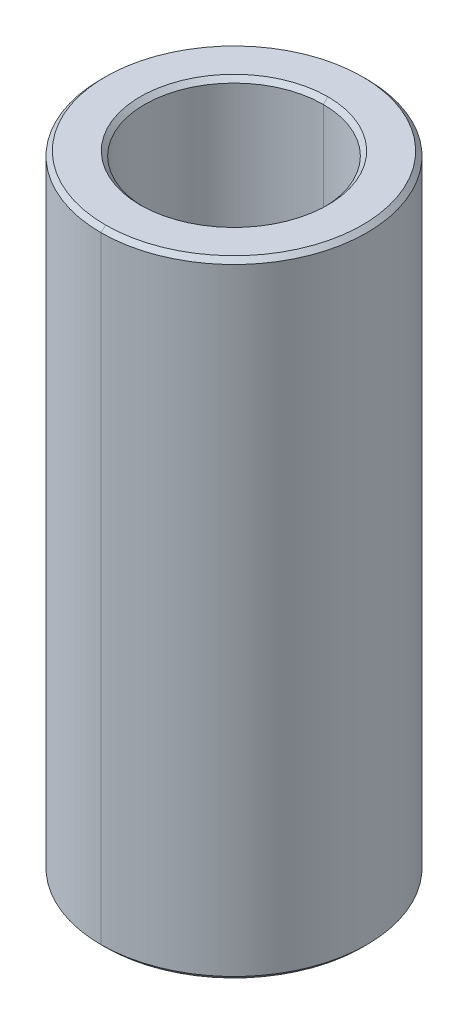
ISO-10303-21;
HEADER;
FILE_DESCRIPTION(('STEP AP214'),'2;1');
FILE_NAME('part.step','',(''),(''),'','','');
FILE_SCHEMA(('AUTOMOTIVE_DESIGN { 1 0 10303 214 1 1 1 1 }'));
ENDSEC;
DATA;
#1=APPLICATION_CONTEXT('core data for automotive mechanical design processes');
#2=APPLICATION_PROTOCOL_DEFINITION('international standard','automotive_design',2000,#1);
#3=PRODUCT_CONTEXT('',#1,'mechanical');
#4=PRODUCT('Part','Part','',(#3));
#5=PRODUCT_RELATED_PRODUCT_CATEGORY('part','',(#4));
#6=PRODUCT_DEFINITION_FORMATION('','',#4);
#7=PRODUCT_DEFINITION_CONTEXT('part definition',#1,'design');
#8=PRODUCT_DEFINITION('design','',#6,#7);
#9=PRODUCT_DEFINITION_SHAPE('','',#8);
#10=(LENGTH_UNIT() NAMED_UNIT(*) SI_UNIT(.MILLI.,.METRE.));
#11=(NAMED_UNIT(*) PLANE_ANGLE_UNIT() SI_UNIT($,.RADIAN.));
#12=(NAMED_UNIT(*) SI_UNIT($,.STERADIAN.) SOLID_ANGLE_UNIT());
#13=UNCERTAINTY_MEASURE_WITH_UNIT(LENGTH_MEASURE(1.E-05),#10,'distance_accuracy_value','');
#14=(GEOMETRIC_REPRESENTATION_CONTEXT(3) GLOBAL_UNCERTAINTY_ASSIGNED_CONTEXT((#13)) GLOBAL_UNIT_ASSIGNED_CONTEXT((#10,
#11,#12)) REPRESENTATION_CONTEXT('',''));
#15=CARTESIAN_POINT('',(0.,0.,0.));
#16=DIRECTION('',(0.,0.,1.));
#17=DIRECTION('',(1.,0.,0.));
#18=AXIS2_PLACEMENT_3D('',#15,#16,#17);
#19=CARTESIAN_POINT('',(0.,6.9,0.));
#20=DIRECTION('',(0.,1.,0.));
#21=DIRECTION('',(0.,0.,1.));
#22=AXIS2_PLACEMENT_3D('',#19,#20,#21);
#23=CONICAL_SURFACE('',#22,2.,0.785398163397448);
#24=DIRECTION('',(0.,0.707106781186548,-0.707106781186548));
#25=VECTOR('',#24,1.);
#26=CARTESIAN_POINT('',(0.,6.9,-2.));
#27=LINE('',#26,#25);
#28=CARTESIAN_POINT('',(0.,6.9,-2.));
#29=VERTEX_POINT('',#28);
#30=CARTESIAN_POINT('',(0.,7.,-2.1));
#31=VERTEX_POINT('',#30);
#32=EDGE_CURVE('E119',#29,#31,#27,.T.);
#33=ORIENTED_EDGE('',*,*,#32,.F.);
#34=CARTESIAN_POINT('',(0.,6.9,0.));
#35=DIRECTION('',(0.,1.,0.));
#36=DIRECTION('',(0.,0.,1.));
#37=AXIS2_PLACEMENT_3D('',#34,#35,#36);
#38=CIRCLE('',#37,2.);
#39=CARTESIAN_POINT('',(0.,6.9,2.));
#40=VERTEX_POINT('',#39);
#41=EDGE_CURVE('E25',#40,#29,#38,.T.);
#42=ORIENTED_EDGE('',*,*,#41,.F.);
#43=DIRECTION('',(0.,0.707106781186548,0.707106781186548));
#44=VECTOR('',#43,1.);
#45=CARTESIAN_POINT('',(0.,6.9,2.));
#46=LINE('',#45,#44);
#47=CARTESIAN_POINT('',(0.,7.,2.1));
#48=VERTEX_POINT('',#47);
#49=EDGE_CURVE('E116',#40,#48,#46,.T.);
#50=ORIENTED_EDGE('',*,*,#49,.T.);
#51=CARTESIAN_POINT('',(0.,7.,0.));
#52=DIRECTION('',(0.,-1.,0.));
#53=DIRECTION('',(0.,0.,1.));
#54=AXIS2_PLACEMENT_3D('',#51,#52,#53);
#55=CIRCLE('',#54,2.1);
#56=EDGE_CURVE('E155',#31,#48,#55,.T.);
#57=ORIENTED_EDGE('',*,*,#56,.F.);
#58=EDGE_LOOP('',(#33,#42,#50,#57));
#59=FACE_BOUND('',#58,.T.);
#60=ADVANCED_FACE('F14',(#59),#23,.F.);
#61=CARTESIAN_POINT('',(0.,-7.,0.));
#62=DIRECTION('',(0.,-1.,0.));
#63=DIRECTION('',(0.,0.,-1.));
#64=AXIS2_PLACEMENT_3D('',#61,#62,#63);
#65=CONICAL_SURFACE('',#64,2.1,0.785398163397457);
#66=DIRECTION('',(0.,-0.707106781186542,0.707106781186554));
#67=VECTOR('',#66,1.);
#68=CARTESIAN_POINT('',(0.,-7.,2.1));
#69=LINE('',#68,#67);
#70=CARTESIAN_POINT('',(0.,-6.9,2.));
#71=VERTEX_POINT('',#70);
#72=CARTESIAN_POINT('',(0.,-7.,2.1));
#73=VERTEX_POINT('',#72);
#74=EDGE_CURVE('E192',#71,#73,#69,.T.);
#75=ORIENTED_EDGE('',*,*,#74,.F.);
#76=CARTESIAN_POINT('',(0.,-6.9,0.));
#77=DIRECTION('',(0.,-1.,0.));
#78=DIRECTION('',(0.,0.,1.));
#79=AXIS2_PLACEMENT_3D('',#76,#77,#78);
#80=CIRCLE('',#79,2.);
#81=CARTESIAN_POINT('',(0.,-6.9,-2.));
#82=VERTEX_POINT('',#81);
#83=EDGE_CURVE('E9',#82,#71,#80,.T.);
#84=ORIENTED_EDGE('',*,*,#83,.F.);
#85=DIRECTION('',(0.,-0.707106781186542,-0.707106781186554));
#86=VECTOR('',#85,1.);
#87=CARTESIAN_POINT('',(0.,-7.,-2.1));
#88=LINE('',#87,#86);
#89=CARTESIAN_POINT('',(0.,-7.,-2.1));
#90=VERTEX_POINT('',#89);
#91=EDGE_CURVE('E200',#82,#90,#88,.T.);
#92=ORIENTED_EDGE('',*,*,#91,.T.);
#93=CARTESIAN_POINT('',(0.,-7.,0.));
#94=DIRECTION('',(0.,1.,0.));
#95=DIRECTION('',(0.,0.,1.));
#96=AXIS2_PLACEMENT_3D('',#93,#94,#95);
#97=CIRCLE('',#96,2.1);
#98=EDGE_CURVE('E68',#73,#90,#97,.T.);
#99=ORIENTED_EDGE('',*,*,#98,.F.);
#100=EDGE_LOOP('',(#75,#84,#92,#99));
#101=FACE_BOUND('',#100,.T.);
#102=ADVANCED_FACE('F16',(#101),#65,.F.);
#103=CARTESIAN_POINT('',(0.,7.,0.));
#104=DIRECTION('',(0.,-1.,0.));
#105=DIRECTION('',(0.,0.,-1.));
#106=AXIS2_PLACEMENT_3D('',#103,#104,#105);
#107=CONICAL_SURFACE('',#106,2.875,0.785398163397448);
#108=DIRECTION('',(0.,-0.707106781186548,0.707106781186548));
#109=VECTOR('',#108,1.);
#110=CARTESIAN_POINT('',(0.,7.,2.875));
#111=LINE('',#110,#109);
#112=CARTESIAN_POINT('',(0.,7.,2.875));
#113=VERTEX_POINT('',#112);
#114=CARTESIAN_POINT('',(0.,6.9,2.975));
#115=VERTEX_POINT('',#114);
#116=EDGE_CURVE('E185',#113,#115,#111,.T.);
#117=ORIENTED_EDGE('',*,*,#116,.F.);
#118=CARTESIAN_POINT('',(0.,7.,0.));
#119=DIRECTION('',(0.,1.,0.));
#120=DIRECTION('',(0.,0.,1.));
#121=AXIS2_PLACEMENT_3D('',#118,#119,#120);
#122=CIRCLE('',#121,2.875);
#123=CARTESIAN_POINT('',(0.,7.,-2.875));
#124=VERTEX_POINT('',#123);
#125=EDGE_CURVE('E56',#124,#113,#122,.T.);
#126=ORIENTED_EDGE('',*,*,#125,.F.);
#127=DIRECTION('',(0.,-0.707106781186548,-0.707106781186548));
#128=VECTOR('',#127,1.);
#129=CARTESIAN_POINT('',(0.,7.,-2.875));
#130=LINE('',#129,#128);
#131=CARTESIAN_POINT('',(0.,6.9,-2.975));
#132=VERTEX_POINT('',#131);
#133=EDGE_CURVE('E163',#124,#132,#130,.T.);
#134=ORIENTED_EDGE('',*,*,#133,.T.);
#135=CARTESIAN_POINT('',(0.,6.9,0.));
#136=DIRECTION('',(0.,-1.,0.));
#137=DIRECTION('',(0.,0.,1.));
#138=AXIS2_PLACEMENT_3D('',#135,#136,#137);
#139=CIRCLE('',#138,2.975);
#140=EDGE_CURVE('E225',#115,#132,#139,.T.);
#141=ORIENTED_EDGE('',*,*,#140,.F.);
#142=EDGE_LOOP('',(#117,#126,#134,#141));
#143=FACE_BOUND('',#142,.T.);
#144=ADVANCED_FACE('F239',(#143),#107,.T.);
#145=CARTESIAN_POINT('',(0.,-6.9,0.));
#146=DIRECTION('',(0.,1.,0.));
#147=DIRECTION('',(0.,0.,1.));
#148=AXIS2_PLACEMENT_3D('',#145,#146,#147);
#149=CONICAL_SURFACE('',#148,2.975,0.785398163397448);
#150=DIRECTION('',(0.,0.707106781186548,-0.707106781186548));
#151=VECTOR('',#150,1.);
#152=CARTESIAN_POINT('',(0.,-6.9,-2.975));
#153=LINE('',#152,#151);
#154=CARTESIAN_POINT('',(0.,-7.,-2.875));
#155=VERTEX_POINT('',#154);
#156=CARTESIAN_POINT('',(0.,-6.9,-2.975));
#157=VERTEX_POINT('',#156);
#158=EDGE_CURVE('E159',#155,#157,#153,.T.);
#159=ORIENTED_EDGE('',*,*,#158,.F.);
#160=CARTESIAN_POINT('',(0.,-7.,0.));
#161=DIRECTION('',(0.,-1.,0.));
#162=DIRECTION('',(0.,0.,1.));
#163=AXIS2_PLACEMENT_3D('',#160,#161,#162);
#164=CIRCLE('',#163,2.875);
#165=CARTESIAN_POINT('',(0.,-7.,2.875));
#166=VERTEX_POINT('',#165);
#167=EDGE_CURVE('E213',#166,#155,#164,.T.);
#168=ORIENTED_EDGE('',*,*,#167,.F.);
#169=DIRECTION('',(0.,0.707106781186548,0.707106781186548));
#170=VECTOR('',#169,1.);
#171=CARTESIAN_POINT('',(0.,-6.9,2.975));
#172=LINE('',#171,#170);
#173=CARTESIAN_POINT('',(0.,-6.9,2.975));
#174=VERTEX_POINT('',#173);
#175=EDGE_CURVE('E134',#166,#174,#172,.T.);
#176=ORIENTED_EDGE('',*,*,#175,.T.);
#177=CARTESIAN_POINT('',(0.,-6.9,0.));
#178=DIRECTION('',(0.,1.,0.));
#179=DIRECTION('',(0.,0.,1.));
#180=AXIS2_PLACEMENT_3D('',#177,#178,#179);
#181=CIRCLE('',#180,2.975);
#182=EDGE_CURVE('E18',#157,#174,#181,.T.);
#183=ORIENTED_EDGE('',*,*,#182,.F.);
#184=EDGE_LOOP('',(#159,#168,#176,#183));
#185=FACE_BOUND('',#184,.T.);
#186=ADVANCED_FACE('F245',(#185),#149,.T.);
#187=CARTESIAN_POINT('',(0.,7.,0.));
#188=DIRECTION('',(0.,-1.,0.));
#189=DIRECTION('',(0.,0.,-1.));
#190=AXIS2_PLACEMENT_3D('',#187,#188,#189);
#191=CYLINDRICAL_SURFACE('',#190,2.);
#192=DIRECTION('',(0.,-1.,0.));
#193=VECTOR('',#192,1.);
#194=CARTESIAN_POINT('',(0.,7.,2.));
#195=LINE('',#194,#193);
#196=EDGE_CURVE('E127',#40,#71,#195,.T.);
#197=ORIENTED_EDGE('',*,*,#196,.F.);
#198=ORIENTED_EDGE('',*,*,#41,.T.);
#199=DIRECTION('',(0.,-1.,0.));
#200=VECTOR('',#199,1.);
#201=CARTESIAN_POINT('',(0.,7.,-2.));
#202=LINE('',#201,#200);
#203=EDGE_CURVE('E133',#29,#82,#202,.T.);
#204=ORIENTED_EDGE('',*,*,#203,.T.);
#205=ORIENTED_EDGE('',*,*,#83,.T.);
#206=EDGE_LOOP('',(#197,#198,#204,#205));
#207=FACE_BOUND('',#206,.T.);
#208=ADVANCED_FACE('F128',(#207),#191,.F.);
#209=CARTESIAN_POINT('',(0.,7.,0.));
#210=DIRECTION('',(0.,-1.,0.));
#211=DIRECTION('',(0.,0.,-1.));
#212=AXIS2_PLACEMENT_3D('',#209,#210,#211);
#213=CYLINDRICAL_SURFACE('',#212,2.975);
#214=DIRECTION('',(0.,-1.,0.));
#215=VECTOR('',#214,1.);
#216=CARTESIAN_POINT('',(0.,7.,2.975));
#217=LINE('',#216,#215);
#218=EDGE_CURVE('E189',#115,#174,#217,.T.);
#219=ORIENTED_EDGE('',*,*,#218,.F.);
#220=ORIENTED_EDGE('',*,*,#140,.T.);
#221=DIRECTION('',(0.,-1.,0.));
#222=VECTOR('',#221,1.);
#223=CARTESIAN_POINT('',(0.,7.,-2.975));
#224=LINE('',#223,#222);
#225=EDGE_CURVE('E190',#132,#157,#224,.T.);
#226=ORIENTED_EDGE('',*,*,#225,.T.);
#227=ORIENTED_EDGE('',*,*,#182,.T.);
#228=EDGE_LOOP('',(#219,#220,#226,#227));
#229=FACE_BOUND('',#228,.T.);
#230=ADVANCED_FACE('F265',(#229),#213,.T.);
#231=CARTESIAN_POINT('',(0.,-7.,0.));
#232=DIRECTION('',(0.,1.,0.));
#233=DIRECTION('',(1.,0.,0.));
#234=AXIS2_PLACEMENT_3D('',#231,#232,#233);
#235=PLANE('',#234);
#236=CARTESIAN_POINT('',(0.,-7.,0.));
#237=DIRECTION('',(0.,1.,0.));
#238=DIRECTION('',(0.,0.,1.));
#239=AXIS2_PLACEMENT_3D('',#236,#237,#238);
#240=CIRCLE('',#239,2.1);
#241=EDGE_CURVE('E196',#90,#73,#240,.T.);
#242=ORIENTED_EDGE('',*,*,#241,.T.);
#243=ORIENTED_EDGE('',*,*,#98,.T.);
#244=EDGE_LOOP('',(#242,#243));
#245=FACE_BOUND('',#244,.T.);
#246=ORIENTED_EDGE('',*,*,#167,.T.);
#247=CARTESIAN_POINT('',(0.,-7.,0.));
#248=DIRECTION('',(0.,-1.,0.));
#249=DIRECTION('',(0.,0.,1.));
#250=AXIS2_PLACEMENT_3D('',#247,#248,#249);
#251=CIRCLE('',#250,2.875);
#252=EDGE_CURVE('E160',#155,#166,#251,.T.);
#253=ORIENTED_EDGE('',*,*,#252,.T.);
#254=EDGE_LOOP('',(#246,#253));
#255=FACE_BOUND('',#254,.T.);
#256=ADVANCED_FACE('F269',(#245,#255),#235,.F.);
#257=CARTESIAN_POINT('',(0.,7.,0.));
#258=DIRECTION('',(0.,1.,0.));
#259=DIRECTION('',(1.,0.,0.));
#260=AXIS2_PLACEMENT_3D('',#257,#258,#259);
#261=PLANE('',#260);
#262=CARTESIAN_POINT('',(0.,7.,0.));
#263=DIRECTION('',(0.,-1.,0.));
#264=DIRECTION('',(0.,0.,1.));
#265=AXIS2_PLACEMENT_3D('',#262,#263,#264);
#266=CIRCLE('',#265,2.1);
#267=EDGE_CURVE('E140',#48,#31,#266,.T.);
#268=ORIENTED_EDGE('',*,*,#267,.T.);
#269=ORIENTED_EDGE('',*,*,#56,.T.);
#270=EDGE_LOOP('',(#268,#269));
#271=FACE_BOUND('',#270,.T.);
#272=ORIENTED_EDGE('',*,*,#125,.T.);
#273=CARTESIAN_POINT('',(0.,7.,0.));
#274=DIRECTION('',(0.,1.,0.));
#275=DIRECTION('',(0.,0.,1.));
#276=AXIS2_PLACEMENT_3D('',#273,#274,#275);
#277=CIRCLE('',#276,2.875);
#278=EDGE_CURVE('E202',#113,#124,#277,.T.);
#279=ORIENTED_EDGE('',*,*,#278,.T.);
#280=EDGE_LOOP('',(#272,#279));
#281=FACE_BOUND('',#280,.T.);
#282=ADVANCED_FACE('F273',(#271,#281),#261,.T.);
#283=CARTESIAN_POINT('',(0.,7.,0.));
#284=DIRECTION('',(0.,-1.,0.));
#285=DIRECTION('',(0.,0.,-1.));
#286=AXIS2_PLACEMENT_3D('',#283,#284,#285);
#287=CYLINDRICAL_SURFACE('',#286,2.975);
#288=CARTESIAN_POINT('',(0.,6.9,0.));
#289=DIRECTION('',(0.,-1.,0.));
#290=DIRECTION('',(0.,0.,1.));
#291=AXIS2_PLACEMENT_3D('',#288,#289,#290);
#292=CIRCLE('',#291,2.975);
#293=EDGE_CURVE('E174',#132,#115,#292,.T.);
#294=ORIENTED_EDGE('',*,*,#293,.T.);
#295=ORIENTED_EDGE('',*,*,#218,.T.);
#296=CARTESIAN_POINT('',(0.,-6.9,0.));
#297=DIRECTION('',(0.,1.,0.));
#298=DIRECTION('',(0.,0.,1.));
#299=AXIS2_PLACEMENT_3D('',#296,#297,#298);
#300=CIRCLE('',#299,2.975);
#301=EDGE_CURVE('E157',#174,#157,#300,.T.);
#302=ORIENTED_EDGE('',*,*,#301,.T.);
#303=ORIENTED_EDGE('',*,*,#225,.F.);
#304=EDGE_LOOP('',(#294,#295,#302,#303));
#305=FACE_BOUND('',#304,.T.);
#306=ADVANCED_FACE('F258',(#305),#287,.T.);
#307=CARTESIAN_POINT('',(0.,7.,0.));
#308=DIRECTION('',(0.,-1.,0.));
#309=DIRECTION('',(0.,0.,-1.));
#310=AXIS2_PLACEMENT_3D('',#307,#308,#309);
#311=CYLINDRICAL_SURFACE('',#310,2.);
#312=CARTESIAN_POINT('',(0.,6.9,0.));
#313=DIRECTION('',(0.,1.,0.));
#314=DIRECTION('',(0.,0.,1.));
#315=AXIS2_PLACEMENT_3D('',#312,#313,#314);
#316=CIRCLE('',#315,2.);
#317=EDGE_CURVE('E138',#29,#40,#316,.T.);
#318=ORIENTED_EDGE('',*,*,#317,.T.);
#319=ORIENTED_EDGE('',*,*,#196,.T.);
#320=CARTESIAN_POINT('',(0.,-6.9,0.));
#321=DIRECTION('',(0.,-1.,0.));
#322=DIRECTION('',(0.,0.,1.));
#323=AXIS2_PLACEMENT_3D('',#320,#321,#322);
#324=CIRCLE('',#323,2.);
#325=EDGE_CURVE('E142',#71,#82,#324,.T.);
#326=ORIENTED_EDGE('',*,*,#325,.T.);
#327=ORIENTED_EDGE('',*,*,#203,.F.);
#328=EDGE_LOOP('',(#318,#319,#326,#327));
#329=FACE_BOUND('',#328,.T.);
#330=ADVANCED_FACE('F144',(#329),#311,.F.);
#331=CARTESIAN_POINT('',(0.,-6.9,0.));
#332=DIRECTION('',(0.,1.,0.));
#333=DIRECTION('',(0.,0.,1.));
#334=AXIS2_PLACEMENT_3D('',#331,#332,#333);
#335=CONICAL_SURFACE('',#334,2.975,0.785398163397448);
#336=ORIENTED_EDGE('',*,*,#252,.F.);
#337=ORIENTED_EDGE('',*,*,#158,.T.);
#338=ORIENTED_EDGE('',*,*,#301,.F.);
#339=ORIENTED_EDGE('',*,*,#175,.F.);
#340=EDGE_LOOP('',(#336,#337,#338,#339));
#341=FACE_BOUND('',#340,.T.);
#342=ADVANCED_FACE('F257',(#341),#335,.T.);
#343=CARTESIAN_POINT('',(0.,7.,0.));
#344=DIRECTION('',(0.,-1.,0.));
#345=DIRECTION('',(0.,0.,-1.));
#346=AXIS2_PLACEMENT_3D('',#343,#344,#345);
#347=CONICAL_SURFACE('',#346,2.875,0.785398163397448);
#348=ORIENTED_EDGE('',*,*,#278,.F.);
#349=ORIENTED_EDGE('',*,*,#116,.T.);
#350=ORIENTED_EDGE('',*,*,#293,.F.);
#351=ORIENTED_EDGE('',*,*,#133,.F.);
#352=EDGE_LOOP('',(#348,#349,#350,#351));
#353=FACE_BOUND('',#352,.T.);
#354=ADVANCED_FACE('F259',(#353),#347,.T.);
#355=CARTESIAN_POINT('',(0.,-7.,0.));
#356=DIRECTION('',(0.,-1.,0.));
#357=DIRECTION('',(0.,0.,-1.));
#358=AXIS2_PLACEMENT_3D('',#355,#356,#357);
#359=CONICAL_SURFACE('',#358,2.1,0.785398163397457);
#360=ORIENTED_EDGE('',*,*,#325,.F.);
#361=ORIENTED_EDGE('',*,*,#74,.T.);
#362=ORIENTED_EDGE('',*,*,#241,.F.);
#363=ORIENTED_EDGE('',*,*,#91,.F.);
#364=EDGE_LOOP('',(#360,#361,#362,#363));
#365=FACE_BOUND('',#364,.T.);
#366=ADVANCED_FACE('F237',(#365),#359,.F.);
#367=CARTESIAN_POINT('',(0.,6.9,0.));
#368=DIRECTION('',(0.,1.,0.));
#369=DIRECTION('',(0.,0.,1.));
#370=AXIS2_PLACEMENT_3D('',#367,#368,#369);
#371=CONICAL_SURFACE('',#370,2.,0.785398163397448);
#372=ORIENTED_EDGE('',*,*,#317,.F.);
#373=ORIENTED_EDGE('',*,*,#32,.T.);
#374=ORIENTED_EDGE('',*,*,#267,.F.);
#375=ORIENTED_EDGE('',*,*,#49,.F.);
#376=EDGE_LOOP('',(#372,#373,#374,#375));
#377=FACE_BOUND('',#376,.T.);
#378=ADVANCED_FACE('F137',(#377),#371,.F.);
#379=CLOSED_SHELL('',(#60,#102,#144,#186,#208,#230,#256,#282,#306,#330,#342,#354,#366,#378));
#380=MANIFOLD_SOLID_BREP('B1',#379);
#381=ADVANCED_BREP_SHAPE_REPRESENTATION('',(#18,#380),#14);
#382=SHAPE_DEFINITION_REPRESENTATION(#9,#381);
ENDSEC;
END-ISO-10303-21;
